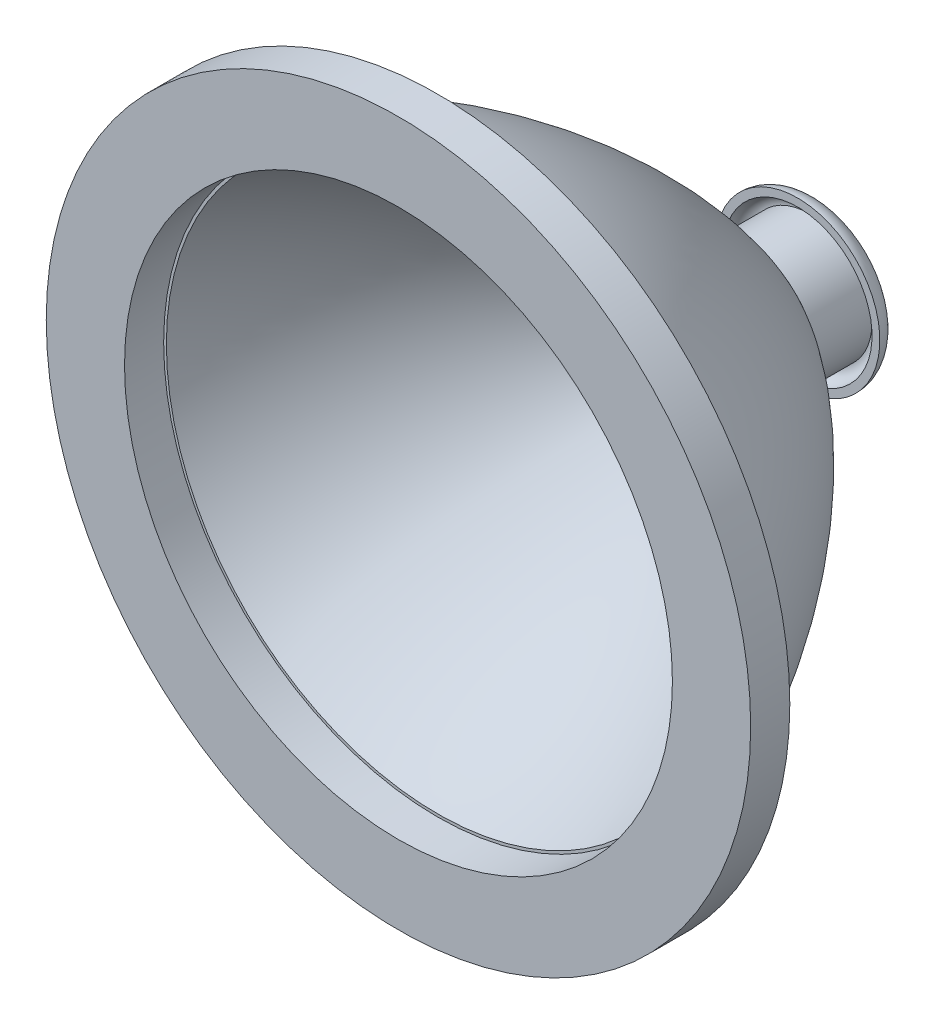
ISO-10303-21;
HEADER;
FILE_DESCRIPTION(('STEP AP214'),'2;1');
FILE_NAME('part.step','',(''),(''),'','','');
FILE_SCHEMA(('AUTOMOTIVE_DESIGN { 1 0 10303 214 1 1 1 1 }'));
ENDSEC;
DATA;
#1=APPLICATION_CONTEXT('core data for automotive mechanical design processes');
#2=APPLICATION_PROTOCOL_DEFINITION('international standard','automotive_design',2000,#1);
#3=PRODUCT_CONTEXT('',#1,'mechanical');
#4=PRODUCT('Part','Part','',(#3));
#5=PRODUCT_RELATED_PRODUCT_CATEGORY('part','',(#4));
#6=PRODUCT_DEFINITION_FORMATION('','',#4);
#7=PRODUCT_DEFINITION_CONTEXT('part definition',#1,'design');
#8=PRODUCT_DEFINITION('design','',#6,#7);
#9=PRODUCT_DEFINITION_SHAPE('','',#8);
#10=(LENGTH_UNIT() NAMED_UNIT(*) SI_UNIT(.MILLI.,.METRE.));
#11=(NAMED_UNIT(*) PLANE_ANGLE_UNIT() SI_UNIT($,.RADIAN.));
#12=(NAMED_UNIT(*) SI_UNIT($,.STERADIAN.) SOLID_ANGLE_UNIT());
#13=UNCERTAINTY_MEASURE_WITH_UNIT(LENGTH_MEASURE(1.E-05),#10,'distance_accuracy_value','');
#14=(GEOMETRIC_REPRESENTATION_CONTEXT(3) GLOBAL_UNCERTAINTY_ASSIGNED_CONTEXT((#13)) GLOBAL_UNIT_ASSIGNED_CONTEXT((#10,
#11,#12)) REPRESENTATION_CONTEXT('',''));
#15=CARTESIAN_POINT('',(0.,0.,0.));
#16=DIRECTION('',(0.,0.,1.));
#17=DIRECTION('',(1.,0.,0.));
#18=AXIS2_PLACEMENT_3D('',#15,#16,#17);
#19=CARTESIAN_POINT('',(0.,0.,0.));
#20=DIRECTION('',(0.,0.,-1.));
#21=DIRECTION('',(-1.,0.,0.));
#22=AXIS2_PLACEMENT_3D('',#19,#20,#21);
#23=PLANE('',#22);
#24=CARTESIAN_POINT('',(0.,0.,0.));
#25=DIRECTION('',(0.,0.,-1.));
#26=DIRECTION('',(-1.,0.,0.));
#27=AXIS2_PLACEMENT_3D('',#24,#25,#26);
#28=CIRCLE('',#27,44.0129431509694);
#29=CARTESIAN_POINT('',(-44.0129431509694,0.,0.));
#30=VERTEX_POINT('',#29);
#31=EDGE_CURVE('E48',#30,#30,#28,.F.);
#32=ORIENTED_EDGE('',*,*,#31,.F.);
#33=EDGE_LOOP('',(#32));
#34=FACE_BOUND('',#33,.T.);
#35=CARTESIAN_POINT('',(0.,0.,0.));
#36=DIRECTION('',(0.,0.,1.));
#37=DIRECTION('',(1.,0.,0.));
#38=AXIS2_PLACEMENT_3D('',#35,#36,#37);
#39=CIRCLE('',#38,44.45);
#40=CARTESIAN_POINT('',(44.45,0.,0.));
#41=VERTEX_POINT('',#40);
#42=EDGE_CURVE('E91',#41,#41,#39,.T.);
#43=ORIENTED_EDGE('',*,*,#42,.T.);
#44=EDGE_LOOP('',(#43));
#45=FACE_BOUND('',#44,.T.);
#46=ADVANCED_FACE('F38',(#34,#45),#23,.F.);
#47=CARTESIAN_POINT('',(0.,0.,-60.96));
#48=DIRECTION('',(0.,0.,1.));
#49=DIRECTION('',(1.,0.,0.));
#50=AXIS2_PLACEMENT_3D('',#47,#48,#49);
#51=CYLINDRICAL_SURFACE('',#50,10.16);
#52=CARTESIAN_POINT('',(0.,0.,-50.8));
#53=DIRECTION('',(0.,0.,-1.));
#54=DIRECTION('',(-1.,0.,0.));
#55=AXIS2_PLACEMENT_3D('',#52,#53,#54);
#56=CIRCLE('',#55,10.16);
#57=CARTESIAN_POINT('',(-10.16,0.,-50.8));
#58=VERTEX_POINT('',#57);
#59=EDGE_CURVE('E57',#58,#58,#56,.T.);
#60=ORIENTED_EDGE('',*,*,#59,.T.);
#61=EDGE_LOOP('',(#60));
#62=FACE_BOUND('',#61,.T.);
#63=CARTESIAN_POINT('',(0.,0.,-60.325));
#64=DIRECTION('',(0.,0.,1.));
#65=DIRECTION('',(1.,0.,0.));
#66=AXIS2_PLACEMENT_3D('',#63,#64,#65);
#67=CIRCLE('',#66,10.16);
#68=CARTESIAN_POINT('',(10.16,0.,-60.325));
#69=VERTEX_POINT('',#68);
#70=EDGE_CURVE('E10',#69,#69,#67,.F.);
#71=ORIENTED_EDGE('',*,*,#70,.F.);
#72=EDGE_LOOP('',(#71));
#73=FACE_BOUND('',#72,.T.);
#74=ADVANCED_FACE('F117',(#62,#73),#51,.T.);
#75=CARTESIAN_POINT('',(0.,0.,34.7283102836008));
#76=DIRECTION('',(0.,0.,1.));
#77=DIRECTION('',(1.,0.,0.));
#78=AXIS2_PLACEMENT_3D('',#75,#76,#77);
#79=DEGENERATE_TOROIDAL_SURFACE('',#78,44.680387854501,101.6,.F.);
#80=CARTESIAN_POINT('',(0.,0.,0.));
#81=DIRECTION('',(0.,0.,1.));
#82=DIRECTION('',(1.,0.,0.));
#83=AXIS2_PLACEMENT_3D('',#80,#81,#82);
#84=CIRCLE('',#83,50.8);
#85=CARTESIAN_POINT('',(50.8,0.,0.));
#86=VERTEX_POINT('',#85);
#87=EDGE_CURVE('E44',#86,#86,#84,.T.);
#88=ORIENTED_EDGE('',*,*,#87,.F.);
#89=EDGE_LOOP('',(#88));
#90=FACE_BOUND('',#89,.T.);
#91=ORIENTED_EDGE('',*,*,#59,.F.);
#92=EDGE_LOOP('',(#91));
#93=FACE_BOUND('',#92,.T.);
#94=ADVANCED_FACE('F122',(#90,#93),#79,.F.);
#95=CARTESIAN_POINT('',(0.,0.,34.7283102836008));
#96=DIRECTION('',(0.,0.,1.));
#97=DIRECTION('',(1.,0.,0.));
#98=AXIS2_PLACEMENT_3D('',#95,#96,#97);
#99=DEGENERATE_TOROIDAL_SURFACE('',#98,44.680387854501,95.25,.F.);
#100=ORIENTED_EDGE('',*,*,#31,.T.);
#101=EDGE_LOOP('',(#100));
#102=FACE_BOUND('',#101,.T.);
#103=CARTESIAN_POINT('',(0.,0.,-44.45));
#104=DIRECTION('',(0.,0.,1.));
#105=DIRECTION('',(1.,0.,0.));
#106=AXIS2_PLACEMENT_3D('',#103,#104,#105);
#107=CIRCLE('',#106,8.26635596071235);
#108=CARTESIAN_POINT('',(8.26635596071235,0.,-44.45));
#109=VERTEX_POINT('',#108);
#110=EDGE_CURVE('E52',#109,#109,#107,.T.);
#111=ORIENTED_EDGE('',*,*,#110,.F.);
#112=EDGE_LOOP('',(#111));
#113=FACE_BOUND('',#112,.T.);
#114=ADVANCED_FACE('F256',(#102,#113),#99,.T.);
#115=CARTESIAN_POINT('',(0.,0.,-44.45));
#116=DIRECTION('',(0.,0.,1.));
#117=DIRECTION('',(1.,0.,0.));
#118=AXIS2_PLACEMENT_3D('',#115,#116,#117);
#119=PLANE('',#118);
#120=CARTESIAN_POINT('',(0.,0.,-44.45));
#121=DIRECTION('',(0.,0.,1.));
#122=DIRECTION('',(1.,0.,0.));
#123=AXIS2_PLACEMENT_3D('',#120,#121,#122);
#124=CIRCLE('',#123,7.61999999999999);
#125=CARTESIAN_POINT('',(7.61999999999999,0.,-44.45));
#126=VERTEX_POINT('',#125);
#127=EDGE_CURVE('E69',#126,#126,#124,.T.);
#128=ORIENTED_EDGE('',*,*,#127,.F.);
#129=EDGE_LOOP('',(#128));
#130=FACE_BOUND('',#129,.T.);
#131=ORIENTED_EDGE('',*,*,#110,.T.);
#132=EDGE_LOOP('',(#131));
#133=FACE_BOUND('',#132,.T.);
#134=ADVANCED_FACE('F245',(#130,#133),#119,.T.);
#135=CARTESIAN_POINT('',(0.,0.,-60.96));
#136=DIRECTION('',(0.,0.,-1.));
#137=DIRECTION('',(-1.,0.,0.));
#138=AXIS2_PLACEMENT_3D('',#135,#136,#137);
#139=PLANE('',#138);
#140=CARTESIAN_POINT('',(0.,0.,-60.96));
#141=DIRECTION('',(0.,0.,1.));
#142=DIRECTION('',(1.,0.,0.));
#143=AXIS2_PLACEMENT_3D('',#140,#141,#142);
#144=CIRCLE('',#143,6.74623999999999);
#145=CARTESIAN_POINT('',(6.74623999999999,0.,-60.96));
#146=VERTEX_POINT('',#145);
#147=EDGE_CURVE('E60',#146,#146,#144,.T.);
#148=ORIENTED_EDGE('',*,*,#147,.T.);
#149=EDGE_LOOP('',(#148));
#150=FACE_BOUND('',#149,.T.);
#151=CARTESIAN_POINT('',(0.,0.,-60.96));
#152=DIRECTION('',(0.,0.,-1.));
#153=DIRECTION('',(-1.,0.,0.));
#154=AXIS2_PLACEMENT_3D('',#151,#152,#153);
#155=CIRCLE('',#154,10.16);
#156=CARTESIAN_POINT('',(-10.16,0.,-60.96));
#157=VERTEX_POINT('',#156);
#158=EDGE_CURVE('E72',#157,#157,#155,.T.);
#159=ORIENTED_EDGE('',*,*,#158,.T.);
#160=EDGE_LOOP('',(#159));
#161=FACE_BOUND('',#160,.T.);
#162=ADVANCED_FACE('F234',(#150,#161),#139,.T.);
#163=CARTESIAN_POINT('',(0.,0.,-44.45));
#164=DIRECTION('',(0.,0.,1.));
#165=DIRECTION('',(1.,0.,0.));
#166=AXIS2_PLACEMENT_3D('',#163,#164,#165);
#167=CYLINDRICAL_SURFACE('',#166,6.74624);
#168=ORIENTED_EDGE('',*,*,#147,.F.);
#169=EDGE_LOOP('',(#168));
#170=FACE_BOUND('',#169,.T.);
#171=CARTESIAN_POINT('',(0.,0.,-49.53));
#172=DIRECTION('',(0.,0.,1.));
#173=DIRECTION('',(1.,0.,0.));
#174=AXIS2_PLACEMENT_3D('',#171,#172,#173);
#175=CIRCLE('',#174,6.74624);
#176=CARTESIAN_POINT('',(6.74624,0.,-49.53));
#177=VERTEX_POINT('',#176);
#178=EDGE_CURVE('E63',#177,#177,#175,.T.);
#179=ORIENTED_EDGE('',*,*,#178,.T.);
#180=EDGE_LOOP('',(#179));
#181=FACE_BOUND('',#180,.T.);
#182=ADVANCED_FACE('F223',(#170,#181),#167,.F.);
#183=CARTESIAN_POINT('',(6.74624,0.,-49.53));
#184=DIRECTION('',(0.,0.,-1.));
#185=DIRECTION('',(-1.,0.,0.));
#186=AXIS2_PLACEMENT_3D('',#183,#184,#185);
#187=PLANE('',#186);
#188=ORIENTED_EDGE('',*,*,#178,.F.);
#189=EDGE_LOOP('',(#188));
#190=FACE_BOUND('',#189,.T.);
#191=CARTESIAN_POINT('',(0.,0.,-49.53));
#192=DIRECTION('',(0.,0.,1.));
#193=DIRECTION('',(1.,0.,0.));
#194=AXIS2_PLACEMENT_3D('',#191,#192,#193);
#195=CIRCLE('',#194,7.62);
#196=CARTESIAN_POINT('',(7.62,0.,-49.53));
#197=VERTEX_POINT('',#196);
#198=EDGE_CURVE('E66',#197,#197,#195,.T.);
#199=ORIENTED_EDGE('',*,*,#198,.T.);
#200=EDGE_LOOP('',(#199));
#201=FACE_BOUND('',#200,.T.);
#202=ADVANCED_FACE('F213',(#190,#201),#187,.F.);
#203=CARTESIAN_POINT('',(0.,0.,-44.45));
#204=DIRECTION('',(0.,0.,1.));
#205=DIRECTION('',(1.,0.,0.));
#206=AXIS2_PLACEMENT_3D('',#203,#204,#205);
#207=CYLINDRICAL_SURFACE('',#206,7.61999999999999);
#208=ORIENTED_EDGE('',*,*,#198,.F.);
#209=EDGE_LOOP('',(#208));
#210=FACE_BOUND('',#209,.T.);
#211=ORIENTED_EDGE('',*,*,#127,.T.);
#212=EDGE_LOOP('',(#211));
#213=FACE_BOUND('',#212,.T.);
#214=ADVANCED_FACE('F194',(#210,#213),#207,.F.);
#215=CARTESIAN_POINT('',(0.,0.,-58.42));
#216=DIRECTION('',(0.,0.,-1.));
#217=DIRECTION('',(-1.,0.,0.));
#218=AXIS2_PLACEMENT_3D('',#215,#216,#217);
#219=TOROIDAL_SURFACE('',#218,10.16,3.175);
#220=CARTESIAN_POINT('',(0.,0.,-58.42));
#221=DIRECTION('',(0.,0.,-1.));
#222=DIRECTION('',(-1.,0.,0.));
#223=AXIS2_PLACEMENT_3D('',#220,#221,#222);
#224=CIRCLE('',#223,13.335);
#225=CARTESIAN_POINT('',(-13.335,0.,-58.42));
#226=VERTEX_POINT('',#225);
#227=EDGE_CURVE('E75',#226,#226,#224,.T.);
#228=ORIENTED_EDGE('',*,*,#227,.T.);
#229=EDGE_LOOP('',(#228));
#230=FACE_BOUND('',#229,.T.);
#231=CARTESIAN_POINT('',(0.,0.,-61.595));
#232=DIRECTION('',(0.,0.,-1.));
#233=DIRECTION('',(-1.,0.,0.));
#234=AXIS2_PLACEMENT_3D('',#231,#232,#233);
#235=CIRCLE('',#234,10.16);
#236=CARTESIAN_POINT('',(-10.16,0.,-61.595));
#237=VERTEX_POINT('',#236);
#238=EDGE_CURVE('E81',#237,#237,#235,.T.);
#239=ORIENTED_EDGE('',*,*,#238,.F.);
#240=EDGE_LOOP('',(#239));
#241=FACE_BOUND('',#240,.T.);
#242=ADVANCED_FACE('F183',(#230,#241),#219,.T.);
#243=CARTESIAN_POINT('',(0.,12.065,-58.42));
#244=DIRECTION('',(0.,0.,-1.));
#245=DIRECTION('',(-1.,0.,0.));
#246=AXIS2_PLACEMENT_3D('',#243,#244,#245);
#247=PLANE('',#246);
#248=ORIENTED_EDGE('',*,*,#227,.F.);
#249=EDGE_LOOP('',(#248));
#250=FACE_BOUND('',#249,.T.);
#251=CARTESIAN_POINT('',(0.,0.,-58.42));
#252=DIRECTION('',(0.,0.,-1.));
#253=DIRECTION('',(-1.,0.,0.));
#254=AXIS2_PLACEMENT_3D('',#251,#252,#253);
#255=CIRCLE('',#254,12.065);
#256=CARTESIAN_POINT('',(-12.065,0.,-58.42));
#257=VERTEX_POINT('',#256);
#258=EDGE_CURVE('E78',#257,#257,#255,.T.);
#259=ORIENTED_EDGE('',*,*,#258,.T.);
#260=EDGE_LOOP('',(#259));
#261=FACE_BOUND('',#260,.T.);
#262=ADVANCED_FACE('F172',(#250,#261),#247,.F.);
#263=CARTESIAN_POINT('',(0.,0.,-58.42));
#264=DIRECTION('',(0.,0.,-1.));
#265=DIRECTION('',(-1.,0.,0.));
#266=AXIS2_PLACEMENT_3D('',#263,#264,#265);
#267=TOROIDAL_SURFACE('',#266,10.16,1.905);
#268=ORIENTED_EDGE('',*,*,#258,.F.);
#269=EDGE_LOOP('',(#268));
#270=FACE_BOUND('',#269,.T.);
#271=ORIENTED_EDGE('',*,*,#70,.T.);
#272=EDGE_LOOP('',(#271));
#273=FACE_BOUND('',#272,.T.);
#274=ADVANCED_FACE('F162',(#270,#273),#267,.F.);
#275=CARTESIAN_POINT('',(0.,0.,-55.88));
#276=DIRECTION('',(0.,0.,-1.));
#277=DIRECTION('',(-1.,0.,0.));
#278=AXIS2_PLACEMENT_3D('',#275,#276,#277);
#279=CYLINDRICAL_SURFACE('',#278,10.16);
#280=ORIENTED_EDGE('',*,*,#158,.F.);
#281=EDGE_LOOP('',(#280));
#282=FACE_BOUND('',#281,.T.);
#283=ORIENTED_EDGE('',*,*,#238,.T.);
#284=EDGE_LOOP('',(#283));
#285=FACE_BOUND('',#284,.T.);
#286=ADVANCED_FACE('F112',(#282,#285),#279,.F.);
#287=CARTESIAN_POINT('',(0.,0.,0.));
#288=DIRECTION('',(0.,0.,1.));
#289=DIRECTION('',(1.,0.,0.));
#290=AXIS2_PLACEMENT_3D('',#287,#288,#289);
#291=PLANE('',#290);
#292=CARTESIAN_POINT('',(0.,0.,0.));
#293=DIRECTION('',(0.,0.,1.));
#294=DIRECTION('',(1.,0.,0.));
#295=AXIS2_PLACEMENT_3D('',#292,#293,#294);
#296=CIRCLE('',#295,57.15);
#297=CARTESIAN_POINT('',(57.15,0.,0.));
#298=VERTEX_POINT('',#297);
#299=EDGE_CURVE('E85',#298,#298,#296,.T.);
#300=ORIENTED_EDGE('',*,*,#299,.F.);
#301=EDGE_LOOP('',(#300));
#302=FACE_BOUND('',#301,.T.);
#303=ORIENTED_EDGE('',*,*,#87,.T.);
#304=EDGE_LOOP('',(#303));
#305=FACE_BOUND('',#304,.T.);
#306=ADVANCED_FACE('F103',(#302,#305),#291,.F.);
#307=CARTESIAN_POINT('',(0.,0.,6.35));
#308=DIRECTION('',(0.,0.,1.));
#309=DIRECTION('',(1.,0.,0.));
#310=AXIS2_PLACEMENT_3D('',#307,#308,#309);
#311=PLANE('',#310);
#312=CARTESIAN_POINT('',(0.,0.,6.35));
#313=DIRECTION('',(0.,0.,1.));
#314=DIRECTION('',(1.,0.,0.));
#315=AXIS2_PLACEMENT_3D('',#312,#313,#314);
#316=CIRCLE('',#315,57.15);
#317=CARTESIAN_POINT('',(57.15,0.,6.35));
#318=VERTEX_POINT('',#317);
#319=EDGE_CURVE('E84',#318,#318,#316,.T.);
#320=ORIENTED_EDGE('',*,*,#319,.T.);
#321=EDGE_LOOP('',(#320));
#322=FACE_BOUND('',#321,.T.);
#323=CARTESIAN_POINT('',(0.,0.,6.35));
#324=DIRECTION('',(0.,0.,1.));
#325=DIRECTION('',(1.,0.,0.));
#326=AXIS2_PLACEMENT_3D('',#323,#324,#325);
#327=CIRCLE('',#326,44.45);
#328=CARTESIAN_POINT('',(44.45,0.,6.35));
#329=VERTEX_POINT('',#328);
#330=EDGE_CURVE('E88',#329,#329,#327,.T.);
#331=ORIENTED_EDGE('',*,*,#330,.F.);
#332=EDGE_LOOP('',(#331));
#333=FACE_BOUND('',#332,.T.);
#334=ADVANCED_FACE('F100',(#322,#333),#311,.T.);
#335=CARTESIAN_POINT('',(0.,0.,6.35));
#336=DIRECTION('',(0.,0.,-1.));
#337=DIRECTION('',(-1.,0.,0.));
#338=AXIS2_PLACEMENT_3D('',#335,#336,#337);
#339=CYLINDRICAL_SURFACE('',#338,57.15);
#340=ORIENTED_EDGE('',*,*,#319,.F.);
#341=EDGE_LOOP('',(#340));
#342=FACE_BOUND('',#341,.T.);
#343=ORIENTED_EDGE('',*,*,#299,.T.);
#344=EDGE_LOOP('',(#343));
#345=FACE_BOUND('',#344,.T.);
#346=ADVANCED_FACE('F102',(#342,#345),#339,.T.);
#347=CARTESIAN_POINT('',(0.,0.,6.35));
#348=DIRECTION('',(0.,0.,-1.));
#349=DIRECTION('',(-1.,0.,0.));
#350=AXIS2_PLACEMENT_3D('',#347,#348,#349);
#351=CYLINDRICAL_SURFACE('',#350,44.45);
#352=ORIENTED_EDGE('',*,*,#330,.T.);
#353=EDGE_LOOP('',(#352));
#354=FACE_BOUND('',#353,.T.);
#355=ORIENTED_EDGE('',*,*,#42,.F.);
#356=EDGE_LOOP('',(#355));
#357=FACE_BOUND('',#356,.T.);
#358=ADVANCED_FACE('F97',(#354,#357),#351,.F.);
#359=CLOSED_SHELL('',(#46,#74,#94,#114,#134,#162,#182,#202,#214,#242,#262,#274,#286,#306,#334,
#346,#358));
#360=MANIFOLD_SOLID_BREP('B2',#359);
#361=ADVANCED_BREP_SHAPE_REPRESENTATION('',(#18,#360),#14);
#362=SHAPE_DEFINITION_REPRESENTATION(#9,#361);
ENDSEC;
END-ISO-10303-21;
